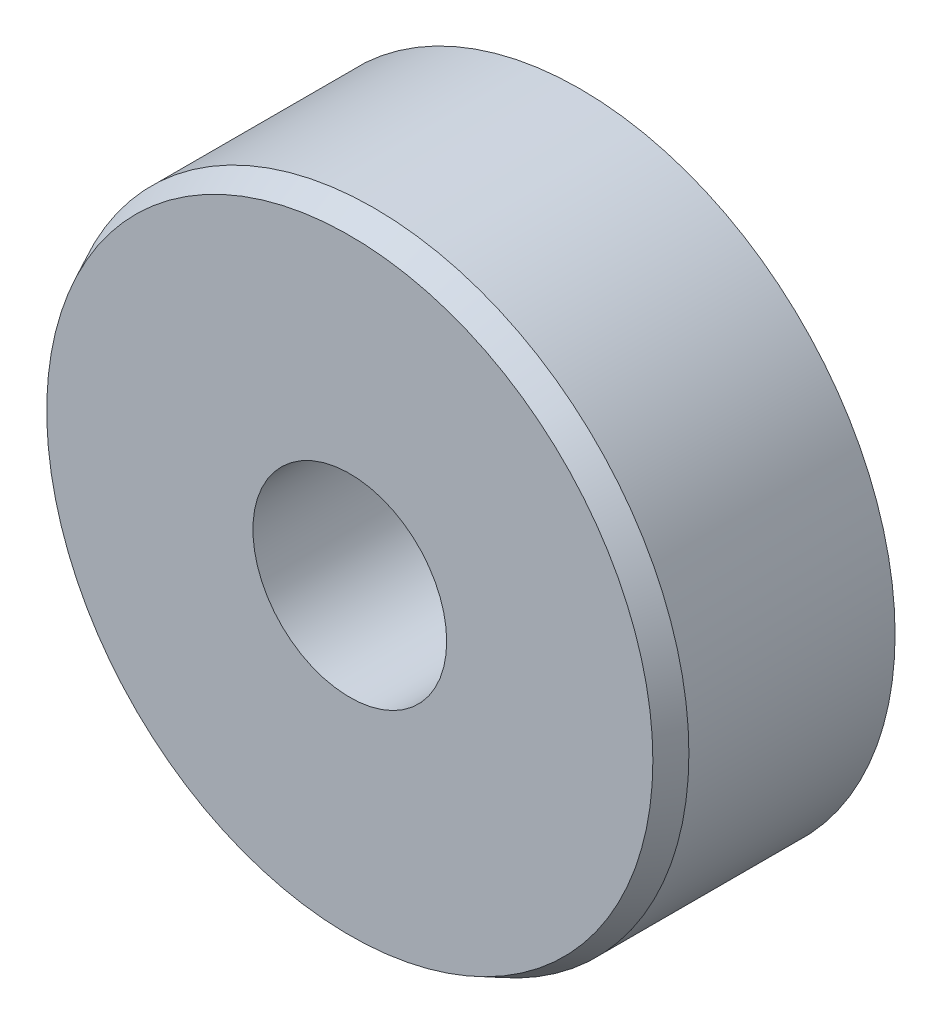
ISO-10303-21;
HEADER;
FILE_DESCRIPTION(('STEP AP214'),'2;1');
FILE_NAME('part.step','',(''),(''),'','','');
FILE_SCHEMA(('AUTOMOTIVE_DESIGN { 1 0 10303 214 1 1 1 1 }'));
ENDSEC;
DATA;
#1=APPLICATION_CONTEXT('core data for automotive mechanical design processes');
#2=APPLICATION_PROTOCOL_DEFINITION('international standard','automotive_design',2000,#1);
#3=PRODUCT_CONTEXT('',#1,'mechanical');
#4=PRODUCT('Part','Part','',(#3));
#5=PRODUCT_RELATED_PRODUCT_CATEGORY('part','',(#4));
#6=PRODUCT_DEFINITION_FORMATION('','',#4);
#7=PRODUCT_DEFINITION_CONTEXT('part definition',#1,'design');
#8=PRODUCT_DEFINITION('design','',#6,#7);
#9=PRODUCT_DEFINITION_SHAPE('','',#8);
#10=(LENGTH_UNIT() NAMED_UNIT(*) SI_UNIT(.MILLI.,.METRE.));
#11=(NAMED_UNIT(*) PLANE_ANGLE_UNIT() SI_UNIT($,.RADIAN.));
#12=(NAMED_UNIT(*) SI_UNIT($,.STERADIAN.) SOLID_ANGLE_UNIT());
#13=UNCERTAINTY_MEASURE_WITH_UNIT(LENGTH_MEASURE(1.E-05),#10,'distance_accuracy_value','');
#14=(GEOMETRIC_REPRESENTATION_CONTEXT(3) GLOBAL_UNCERTAINTY_ASSIGNED_CONTEXT((#13)) GLOBAL_UNIT_ASSIGNED_CONTEXT((#10,
#11,#12)) REPRESENTATION_CONTEXT('',''));
#15=CARTESIAN_POINT('',(0.,0.,0.));
#16=DIRECTION('',(0.,0.,1.));
#17=DIRECTION('',(1.,0.,0.));
#18=AXIS2_PLACEMENT_3D('',#15,#16,#17);
#19=CARTESIAN_POINT('',(0.,0.,5.));
#20=DIRECTION('',(0.,0.,1.));
#21=DIRECTION('',(1.,0.,0.));
#22=AXIS2_PLACEMENT_3D('',#19,#20,#21);
#23=PLANE('',#22);
#24=CARTESIAN_POINT('',(0.,0.,5.));
#25=DIRECTION('',(0.,0.,1.));
#26=DIRECTION('',(1.,0.,0.));
#27=AXIS2_PLACEMENT_3D('',#24,#25,#26);
#28=CIRCLE('',#27,6.25613370571707);
#29=CARTESIAN_POINT('',(6.25613370571707,0.,5.));
#30=VERTEX_POINT('',#29);
#31=EDGE_CURVE('E10',#30,#30,#28,.T.);
#32=ORIENTED_EDGE('',*,*,#31,.T.);
#33=EDGE_LOOP('',(#32));
#34=FACE_BOUND('',#33,.T.);
#35=CARTESIAN_POINT('',(0.,0.,5.));
#36=DIRECTION('',(0.,0.,1.));
#37=DIRECTION('',(1.,0.,0.));
#38=AXIS2_PLACEMENT_3D('',#35,#36,#37);
#39=CIRCLE('',#38,2.);
#40=CARTESIAN_POINT('',(2.,0.,5.));
#41=VERTEX_POINT('',#40);
#42=EDGE_CURVE('E51',#41,#41,#39,.T.);
#43=ORIENTED_EDGE('',*,*,#42,.F.);
#44=EDGE_LOOP('',(#43));
#45=FACE_BOUND('',#44,.T.);
#46=ADVANCED_FACE('F31',(#34,#45),#23,.T.);
#47=CARTESIAN_POINT('',(0.,0.,0.));
#48=DIRECTION('',(0.,0.,1.));
#49=DIRECTION('',(1.,0.,0.));
#50=AXIS2_PLACEMENT_3D('',#47,#48,#49);
#51=PLANE('',#50);
#52=CARTESIAN_POINT('',(0.,0.,0.));
#53=DIRECTION('',(0.,0.,1.));
#54=DIRECTION('',(1.,0.,0.));
#55=AXIS2_PLACEMENT_3D('',#52,#53,#54);
#56=CIRCLE('',#55,5.99999999999999);
#57=CARTESIAN_POINT('',(5.99999999999999,0.,0.));
#58=VERTEX_POINT('',#57);
#59=EDGE_CURVE('E38',#58,#58,#56,.F.);
#60=ORIENTED_EDGE('',*,*,#59,.T.);
#61=EDGE_LOOP('',(#60));
#62=FACE_BOUND('',#61,.T.);
#63=CARTESIAN_POINT('',(0.,0.,0.));
#64=DIRECTION('',(0.,0.,1.));
#65=DIRECTION('',(1.,0.,0.));
#66=AXIS2_PLACEMENT_3D('',#63,#64,#65);
#67=CIRCLE('',#66,2.);
#68=CARTESIAN_POINT('',(2.,0.,0.));
#69=VERTEX_POINT('',#68);
#70=EDGE_CURVE('E52',#69,#69,#67,.T.);
#71=ORIENTED_EDGE('',*,*,#70,.T.);
#72=EDGE_LOOP('',(#71));
#73=FACE_BOUND('',#72,.T.);
#74=ADVANCED_FACE('F62',(#62,#73),#51,.F.);
#75=CARTESIAN_POINT('',(0.,0.,5.));
#76=DIRECTION('',(0.,0.,-1.));
#77=DIRECTION('',(-1.,0.,0.));
#78=AXIS2_PLACEMENT_3D('',#75,#76,#77);
#79=CYLINDRICAL_SURFACE('',#78,6.5);
#80=CARTESIAN_POINT('',(0.,0.,0.243866294282933));
#81=DIRECTION('',(0.,0.,1.));
#82=DIRECTION('',(1.,0.,0.));
#83=AXIS2_PLACEMENT_3D('',#80,#81,#82);
#84=CIRCLE('',#83,6.5);
#85=CARTESIAN_POINT('',(6.5,0.,0.243866294282933));
#86=VERTEX_POINT('',#85);
#87=EDGE_CURVE('E42',#86,#86,#84,.T.);
#88=ORIENTED_EDGE('',*,*,#87,.T.);
#89=EDGE_LOOP('',(#88));
#90=FACE_BOUND('',#89,.T.);
#91=CARTESIAN_POINT('',(0.,0.,4.5));
#92=DIRECTION('',(0.,0.,1.));
#93=DIRECTION('',(1.,0.,0.));
#94=AXIS2_PLACEMENT_3D('',#91,#92,#93);
#95=CIRCLE('',#94,6.5);
#96=CARTESIAN_POINT('',(6.5,0.,4.5));
#97=VERTEX_POINT('',#96);
#98=EDGE_CURVE('E46',#97,#97,#95,.F.);
#99=ORIENTED_EDGE('',*,*,#98,.T.);
#100=EDGE_LOOP('',(#99));
#101=FACE_BOUND('',#100,.T.);
#102=ADVANCED_FACE('F67',(#90,#101),#79,.T.);
#103=CARTESIAN_POINT('',(0.,0.,5.));
#104=DIRECTION('',(0.,0.,-1.));
#105=DIRECTION('',(-1.,0.,0.));
#106=AXIS2_PLACEMENT_3D('',#103,#104,#105);
#107=CYLINDRICAL_SURFACE('',#106,2.);
#108=ORIENTED_EDGE('',*,*,#42,.T.);
#109=EDGE_LOOP('',(#108));
#110=FACE_BOUND('',#109,.T.);
#111=ORIENTED_EDGE('',*,*,#70,.F.);
#112=EDGE_LOOP('',(#111));
#113=FACE_BOUND('',#112,.T.);
#114=ADVANCED_FACE('F58',(#110,#113),#107,.F.);
#115=CARTESIAN_POINT('',(0.,0.,0.243866294282933));
#116=DIRECTION('',(0.,0.,1.));
#117=DIRECTION('',(1.,0.,0.));
#118=AXIS2_PLACEMENT_3D('',#115,#116,#117);
#119=CONICAL_SURFACE('',#118,6.5,1.11701072127637);
#120=ORIENTED_EDGE('',*,*,#59,.F.);
#121=EDGE_LOOP('',(#120));
#122=FACE_BOUND('',#121,.T.);
#123=ORIENTED_EDGE('',*,*,#87,.F.);
#124=EDGE_LOOP('',(#123));
#125=FACE_BOUND('',#124,.T.);
#126=ADVANCED_FACE('F73',(#122,#125),#119,.T.);
#127=CARTESIAN_POINT('',(0.,0.,5.));
#128=DIRECTION('',(0.,0.,-1.));
#129=DIRECTION('',(-1.,0.,0.));
#130=AXIS2_PLACEMENT_3D('',#127,#128,#129);
#131=CONICAL_SURFACE('',#130,6.25613370571707,0.453785605518522);
#132=ORIENTED_EDGE('',*,*,#98,.F.);
#133=EDGE_LOOP('',(#132));
#134=FACE_BOUND('',#133,.T.);
#135=ORIENTED_EDGE('',*,*,#31,.F.);
#136=EDGE_LOOP('',(#135));
#137=FACE_BOUND('',#136,.T.);
#138=ADVANCED_FACE('F33',(#134,#137),#131,.T.);
#139=CLOSED_SHELL('',(#46,#74,#102,#114,#126,#138));
#140=MANIFOLD_SOLID_BREP('B2',#139);
#141=ADVANCED_BREP_SHAPE_REPRESENTATION('',(#18,#140),#14);
#142=SHAPE_DEFINITION_REPRESENTATION(#9,#141);
ENDSEC;
END-ISO-10303-21;
